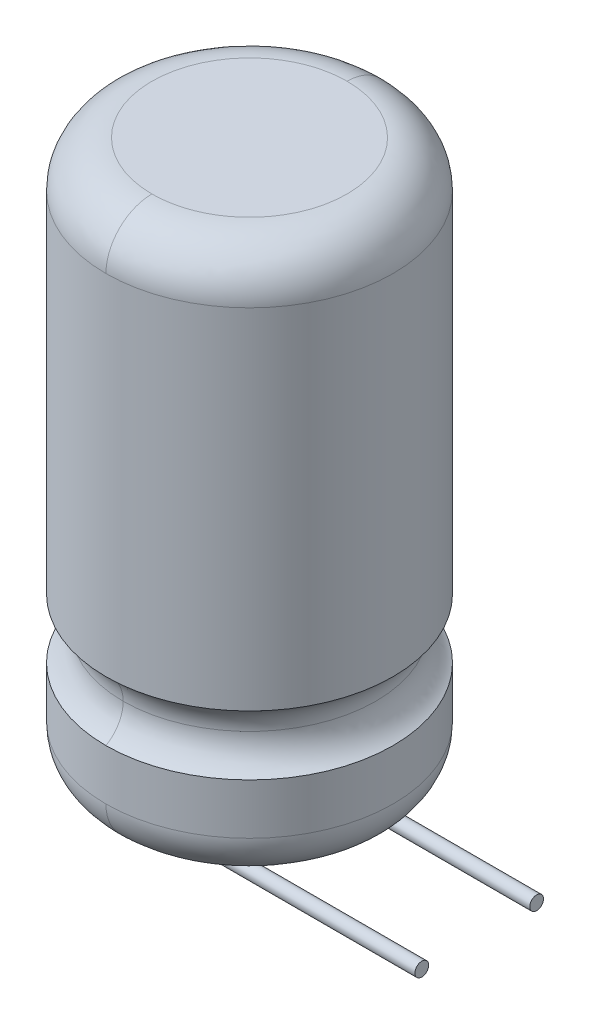
ISO-10303-21;
HEADER;
FILE_DESCRIPTION(('STEP AP214'),'2;1');
FILE_NAME('part.step','',(''),(''),'','','');
FILE_SCHEMA(('AUTOMOTIVE_DESIGN { 1 0 10303 214 1 1 1 1 }'));
ENDSEC;
DATA;
#1=APPLICATION_CONTEXT('core data for automotive mechanical design processes');
#2=APPLICATION_PROTOCOL_DEFINITION('international standard','automotive_design',2000,#1);
#3=PRODUCT_CONTEXT('',#1,'mechanical');
#4=PRODUCT('Part','Part','',(#3));
#5=PRODUCT_RELATED_PRODUCT_CATEGORY('part','',(#4));
#6=PRODUCT_DEFINITION_FORMATION('','',#4);
#7=PRODUCT_DEFINITION_CONTEXT('part definition',#1,'design');
#8=PRODUCT_DEFINITION('design','',#6,#7);
#9=PRODUCT_DEFINITION_SHAPE('','',#8);
#10=(LENGTH_UNIT() NAMED_UNIT(*) SI_UNIT(.MILLI.,.METRE.));
#11=(NAMED_UNIT(*) PLANE_ANGLE_UNIT() SI_UNIT($,.RADIAN.));
#12=(NAMED_UNIT(*) SI_UNIT($,.STERADIAN.) SOLID_ANGLE_UNIT());
#13=UNCERTAINTY_MEASURE_WITH_UNIT(LENGTH_MEASURE(1.E-05),#10,'distance_accuracy_value','');
#14=(GEOMETRIC_REPRESENTATION_CONTEXT(3) GLOBAL_UNCERTAINTY_ASSIGNED_CONTEXT((#13)) GLOBAL_UNIT_ASSIGNED_CONTEXT((#10,
#11,#12)) REPRESENTATION_CONTEXT('',''));
#15=CARTESIAN_POINT('',(0.,0.,0.));
#16=DIRECTION('',(0.,0.,1.));
#17=DIRECTION('',(1.,0.,0.));
#18=AXIS2_PLACEMENT_3D('',#15,#16,#17);
#19=CARTESIAN_POINT('',(10.,-1.4036,2.8036));
#20=DIRECTION('',(1.,0.,0.));
#21=DIRECTION('',(0.,0.,-1.));
#22=AXIS2_PLACEMENT_3D('',#19,#20,#21);
#23=PLANE('',#22);
#24=CARTESIAN_POINT('',(10.,-1.1,2.5));
#25=DIRECTION('',(1.,0.,0.));
#26=DIRECTION('',(0.,0.,-1.));
#27=AXIS2_PLACEMENT_3D('',#24,#25,#26);
#28=CIRCLE('',#27,0.3);
#29=CARTESIAN_POINT('',(10.,-1.1,2.2));
#30=VERTEX_POINT('',#29);
#31=EDGE_CURVE('E107',#30,#30,#28,.T.);
#32=ORIENTED_EDGE('',*,*,#31,.T.);
#33=EDGE_LOOP('',(#32));
#34=FACE_BOUND('',#33,.T.);
#35=ADVANCED_FACE('F16',(#34),#23,.T.);
#36=CARTESIAN_POINT('',(10.,-1.4036,-2.1964));
#37=DIRECTION('',(1.,0.,0.));
#38=DIRECTION('',(0.,0.,-1.));
#39=AXIS2_PLACEMENT_3D('',#36,#37,#38);
#40=PLANE('',#39);
#41=CARTESIAN_POINT('',(10.,-1.1,-2.5));
#42=DIRECTION('',(1.,0.,0.));
#43=DIRECTION('',(0.,0.,-1.));
#44=AXIS2_PLACEMENT_3D('',#41,#42,#43);
#45=CIRCLE('',#44,0.3);
#46=CARTESIAN_POINT('',(10.,-1.1,-2.8));
#47=VERTEX_POINT('',#46);
#48=EDGE_CURVE('E106',#47,#47,#45,.T.);
#49=ORIENTED_EDGE('',*,*,#48,.T.);
#50=EDGE_LOOP('',(#49));
#51=FACE_BOUND('',#50,.T.);
#52=ADVANCED_FACE('F150',(#51),#40,.T.);
#53=CARTESIAN_POINT('',(1.,-1.1,2.5));
#54=DIRECTION('',(1.,0.,0.));
#55=DIRECTION('',(0.,0.,-1.));
#56=AXIS2_PLACEMENT_3D('',#53,#54,#55);
#57=CYLINDRICAL_SURFACE('',#56,0.3);
#58=ORIENTED_EDGE('',*,*,#31,.F.);
#59=EDGE_LOOP('',(#58));
#60=FACE_BOUND('',#59,.T.);
#61=CARTESIAN_POINT('',(1.,-1.1,2.5));
#62=DIRECTION('',(1.,0.,0.));
#63=DIRECTION('',(0.,0.,-1.));
#64=AXIS2_PLACEMENT_3D('',#61,#62,#63);
#65=CIRCLE('',#64,0.3);
#66=CARTESIAN_POINT('',(1.,-1.40000000010315,2.49999999996849));
#67=VERTEX_POINT('',#66);
#68=CARTESIAN_POINT('',(1.,-0.8,2.50000000006153));
#69=VERTEX_POINT('',#68);
#70=EDGE_CURVE('E101',#67,#69,#65,.F.);
#71=ORIENTED_EDGE('',*,*,#70,.F.);
#72=CARTESIAN_POINT('',(1.,-1.1,2.5));
#73=DIRECTION('',(1.,0.,0.));
#74=DIRECTION('',(0.,0.,-1.));
#75=AXIS2_PLACEMENT_3D('',#72,#73,#74);
#76=CIRCLE('',#75,0.3);
#77=EDGE_CURVE('E98',#69,#67,#76,.F.);
#78=ORIENTED_EDGE('',*,*,#77,.F.);
#79=EDGE_LOOP('',(#71,#78));
#80=FACE_BOUND('',#79,.T.);
#81=ADVANCED_FACE('F100',(#60,#80),#57,.T.);
#82=CARTESIAN_POINT('',(1.,-1.1,-2.5));
#83=DIRECTION('',(1.,0.,0.));
#84=DIRECTION('',(0.,0.,-1.));
#85=AXIS2_PLACEMENT_3D('',#82,#83,#84);
#86=CYLINDRICAL_SURFACE('',#85,0.3);
#87=ORIENTED_EDGE('',*,*,#48,.F.);
#88=EDGE_LOOP('',(#87));
#89=FACE_BOUND('',#88,.T.);
#90=CARTESIAN_POINT('',(1.,-1.1,-2.5));
#91=DIRECTION('',(1.,0.,0.));
#92=DIRECTION('',(0.,0.,-1.));
#93=AXIS2_PLACEMENT_3D('',#90,#91,#92);
#94=CIRCLE('',#93,0.3);
#95=CARTESIAN_POINT('',(1.,-1.40000000010315,-2.50000000003151));
#96=VERTEX_POINT('',#95);
#97=CARTESIAN_POINT('',(1.,-0.8,-2.49999999993847));
#98=VERTEX_POINT('',#97);
#99=EDGE_CURVE('E122',#96,#98,#94,.F.);
#100=ORIENTED_EDGE('',*,*,#99,.F.);
#101=CARTESIAN_POINT('',(1.,-1.1,-2.5));
#102=DIRECTION('',(1.,0.,0.));
#103=DIRECTION('',(0.,0.,-1.));
#104=AXIS2_PLACEMENT_3D('',#101,#102,#103);
#105=CIRCLE('',#104,0.3);
#106=EDGE_CURVE('E116',#98,#96,#105,.F.);
#107=ORIENTED_EDGE('',*,*,#106,.F.);
#108=EDGE_LOOP('',(#100,#107));
#109=FACE_BOUND('',#108,.T.);
#110=ADVANCED_FACE('F218',(#89,#109),#86,.T.);
#111=CARTESIAN_POINT('',(0.29850125,-0.1,2.470049975));
#112=CARTESIAN_POINT('',(0.29850125,-0.510928454,2.470049975));
#113=CARTESIAN_POINT('',(0.589071546,-0.80149875,2.470049975));
#114=CARTESIAN_POINT('',(1.,-0.80149875,2.470049975));
#115=CARTESIAN_POINT('',(0.317469721,-0.1,2.659101988));
#116=CARTESIAN_POINT('',(0.317469721,-0.499816981,2.659101988));
#117=CARTESIAN_POINT('',(0.600183019,-0.782530279,2.659101988));
#118=CARTESIAN_POINT('',(1.,-0.782530279,2.659101988));
#119=CARTESIAN_POINT('',(0.190001228,-0.1,2.8));
#120=CARTESIAN_POINT('',(0.190001228,-0.574486295,2.8));
#121=CARTESIAN_POINT('',(0.525513705,-0.909998772,2.8));
#122=CARTESIAN_POINT('',(1.,-0.909998772,2.8));
#123=CARTESIAN_POINT('',(0.,-0.1,2.8));
#124=CARTESIAN_POINT('',(0.,-0.685786438,2.8));
#125=CARTESIAN_POINT('',(0.414213562,-1.1,2.8));
#126=CARTESIAN_POINT('',(1.,-1.1,2.8));
#127=CARTESIAN_POINT('',(-0.190001228,-0.1,2.8));
#128=CARTESIAN_POINT('',(-0.190001228,-0.79708658,2.8));
#129=CARTESIAN_POINT('',(0.30291342,-1.290001228,2.8));
#130=CARTESIAN_POINT('',(1.,-1.290001228,2.8));
#131=CARTESIAN_POINT('',(-0.317469721,-0.1,2.659101988));
#132=CARTESIAN_POINT('',(-0.317469721,-0.871755895,2.659101988));
#133=CARTESIAN_POINT('',(0.228244105,-1.417469721,2.659101988));
#134=CARTESIAN_POINT('',(1.,-1.417469721,2.659101988));
#135=CARTESIAN_POINT('',(-0.29850125,-0.1,2.470049975));
#136=CARTESIAN_POINT('',(-0.29850125,-0.860644421,2.470049975));
#137=CARTESIAN_POINT('',(0.239355579,-1.39850125,2.470049975));
#138=CARTESIAN_POINT('',(1.,-1.39850125,2.470049975));
#139=(BOUNDED_SURFACE() B_SPLINE_SURFACE(3,3,((#111,#112,#113,#114),(#115,#116,#117,#118),(#119,
#120,#121,#122),(#123,#124,#125,#126),(#127,#128,#129,#130),(#131,#132,#133,#134),(#135,#136,
#137,#138)),.UNSPECIFIED.,.F.,.F.,.F.) B_SPLINE_SURFACE_WITH_KNOTS((4,3,4),(4,4),(0.,0.5,1.),
(0.,1.),.UNSPECIFIED.) GEOMETRIC_REPRESENTATION_ITEM() RATIONAL_B_SPLINE_SURFACE(((1.,
0.804737854124365,0.804737854124365,1.),(0.780588314885162,0.62816896547524,0.62816896547524,
0.780588314885162),(0.780588314885162,0.62816896547524,0.62816896547524,0.780588314885162),(1.,
0.804737854124365,0.804737854124365,1.),(0.780588314885162,0.62816896547524,0.62816896547524,
0.780588314885162),(0.780588314885162,0.62816896547524,0.62816896547524,0.780588314885162),(1.,
0.804737854124365,0.804737854124365,1.))) REPRESENTATION_ITEM('') SURFACE());
#140=CARTESIAN_POINT('',(1.,-0.0999999999999998,2.50000000032535));
#141=DIRECTION('',(0.,0.,-1.));
#142=DIRECTION('',(-1.,0.,0.));
#143=AXIS2_PLACEMENT_3D('',#140,#141,#142);
#144=CIRCLE('',#143,0.699999999690537);
#145=CARTESIAN_POINT('',(0.300000000154731,-0.1,2.50000000013191));
#146=VERTEX_POINT('',#145);
#147=EDGE_CURVE('E113',#69,#146,#144,.T.);
#148=CARTESIAN_POINT('',(0.,-0.1,2.5));
#149=DIRECTION('',(0.,1.,0.));
#150=DIRECTION('',(0.,0.,1.));
#151=AXIS2_PLACEMENT_3D('',#148,#149,#150);
#152=CIRCLE('',#151,0.3);
#153=CARTESIAN_POINT('',(-0.300000000154732,-0.1,2.49999999977962));
#154=VERTEX_POINT('',#153);
#155=EDGE_CURVE('E120',#146,#154,#152,.F.);
#156=CARTESIAN_POINT('',(0.999999999999999,-0.1,2.49999999967465));
#157=DIRECTION('',(0.,0.,-1.));
#158=DIRECTION('',(-1.,0.,0.));
#159=AXIS2_PLACEMENT_3D('',#156,#157,#158);
#160=CIRCLE('',#159,1.30000000030946);
#161=EDGE_CURVE('E115',#67,#154,#160,.T.);
#162=ORIENTED_EDGE('',*,*,#147,.T.);
#163=ORIENTED_EDGE('',*,*,#155,.T.);
#164=ORIENTED_EDGE('',*,*,#161,.F.);
#165=ORIENTED_EDGE('',*,*,#70,.T.);
#166=EDGE_LOOP('',(#162,#163,#164,#165));
#167=FACE_BOUND('',#166,.T.);
#168=ADVANCED_FACE('F111',(#167),#139,.T.);
#169=CARTESIAN_POINT('',(0.29850125,-0.1,-2.529950025));
#170=CARTESIAN_POINT('',(0.29850125,-0.510928454,-2.529950025));
#171=CARTESIAN_POINT('',(0.589071546,-0.80149875,-2.529950025));
#172=CARTESIAN_POINT('',(1.,-0.80149875,-2.529950025));
#173=CARTESIAN_POINT('',(0.317469721,-0.1,-2.340898012));
#174=CARTESIAN_POINT('',(0.317469721,-0.499816981,-2.340898012));
#175=CARTESIAN_POINT('',(0.600183019,-0.782530279,-2.340898012));
#176=CARTESIAN_POINT('',(1.,-0.782530279,-2.340898012));
#177=CARTESIAN_POINT('',(0.190001228,-0.1,-2.2));
#178=CARTESIAN_POINT('',(0.190001228,-0.574486295,-2.2));
#179=CARTESIAN_POINT('',(0.525513705,-0.909998772,-2.2));
#180=CARTESIAN_POINT('',(1.,-0.909998772,-2.2));
#181=CARTESIAN_POINT('',(0.,-0.1,-2.2));
#182=CARTESIAN_POINT('',(0.,-0.685786438,-2.2));
#183=CARTESIAN_POINT('',(0.414213562,-1.1,-2.2));
#184=CARTESIAN_POINT('',(1.,-1.1,-2.2));
#185=CARTESIAN_POINT('',(-0.190001228,-0.1,-2.2));
#186=CARTESIAN_POINT('',(-0.190001228,-0.79708658,-2.2));
#187=CARTESIAN_POINT('',(0.30291342,-1.290001228,-2.2));
#188=CARTESIAN_POINT('',(1.,-1.290001228,-2.2));
#189=CARTESIAN_POINT('',(-0.317469721,-0.1,-2.340898012));
#190=CARTESIAN_POINT('',(-0.317469721,-0.871755895,-2.340898012));
#191=CARTESIAN_POINT('',(0.228244105,-1.417469721,-2.340898012));
#192=CARTESIAN_POINT('',(1.,-1.417469721,-2.340898012));
#193=CARTESIAN_POINT('',(-0.29850125,-0.1,-2.529950025));
#194=CARTESIAN_POINT('',(-0.29850125,-0.860644421,-2.529950025));
#195=CARTESIAN_POINT('',(0.239355579,-1.39850125,-2.529950025));
#196=CARTESIAN_POINT('',(1.,-1.39850125,-2.529950025));
#197=(BOUNDED_SURFACE() B_SPLINE_SURFACE(3,3,((#169,#170,#171,#172),(#173,#174,#175,#176),(#177,
#178,#179,#180),(#181,#182,#183,#184),(#185,#186,#187,#188),(#189,#190,#191,#192),(#193,#194,
#195,#196)),.UNSPECIFIED.,.F.,.F.,.F.) B_SPLINE_SURFACE_WITH_KNOTS((4,3,4),(4,4),(0.,0.5,1.),
(0.,1.),.UNSPECIFIED.) GEOMETRIC_REPRESENTATION_ITEM() RATIONAL_B_SPLINE_SURFACE(((1.,
0.804737854124365,0.804737854124365,1.),(0.780588314885162,0.62816896547524,0.62816896547524,
0.780588314885162),(0.780588314885162,0.62816896547524,0.62816896547524,0.780588314885162),(1.,
0.804737854124365,0.804737854124365,1.),(0.780588314885162,0.62816896547524,0.62816896547524,
0.780588314885162),(0.780588314885162,0.62816896547524,0.62816896547524,0.780588314885162),(1.,
0.804737854124365,0.804737854124365,1.))) REPRESENTATION_ITEM('') SURFACE());
#198=CARTESIAN_POINT('',(1.,-0.0999999999999998,-2.49999999967465));
#199=DIRECTION('',(0.,0.,-1.));
#200=DIRECTION('',(-1.,0.,0.));
#201=AXIS2_PLACEMENT_3D('',#198,#199,#200);
#202=CIRCLE('',#201,0.699999999690537);
#203=CARTESIAN_POINT('',(0.300000000154731,-0.1,-2.49999999986809));
#204=VERTEX_POINT('',#203);
#205=EDGE_CURVE('E193',#98,#204,#202,.T.);
#206=CARTESIAN_POINT('',(0.,-0.1,-2.5));
#207=DIRECTION('',(0.,1.,0.));
#208=DIRECTION('',(0.,0.,1.));
#209=AXIS2_PLACEMENT_3D('',#206,#207,#208);
#210=CIRCLE('',#209,0.3);
#211=CARTESIAN_POINT('',(-0.300000000154732,-0.1,-2.50000000022038));
#212=VERTEX_POINT('',#211);
#213=EDGE_CURVE('E192',#204,#212,#210,.F.);
#214=CARTESIAN_POINT('',(0.999999999999999,-0.1,-2.50000000032535));
#215=DIRECTION('',(0.,0.,-1.));
#216=DIRECTION('',(-1.,0.,0.));
#217=AXIS2_PLACEMENT_3D('',#214,#215,#216);
#218=CIRCLE('',#217,1.30000000030946);
#219=EDGE_CURVE('E215',#96,#212,#218,.T.);
#220=ORIENTED_EDGE('',*,*,#205,.T.);
#221=ORIENTED_EDGE('',*,*,#213,.T.);
#222=ORIENTED_EDGE('',*,*,#219,.F.);
#223=ORIENTED_EDGE('',*,*,#99,.T.);
#224=EDGE_LOOP('',(#220,#221,#222,#223));
#225=FACE_BOUND('',#224,.T.);
#226=ADVANCED_FACE('F219',(#225),#197,.T.);
#227=CARTESIAN_POINT('',(-0.29850125,-0.1,2.529950025));
#228=CARTESIAN_POINT('',(-0.29850125,-0.860644421,2.529950025));
#229=CARTESIAN_POINT('',(0.239355579,-1.39850125,2.529950025));
#230=CARTESIAN_POINT('',(1.,-1.39850125,2.529950025));
#231=CARTESIAN_POINT('',(-0.317469721,-0.1,2.340898012));
#232=CARTESIAN_POINT('',(-0.317469721,-0.871755895,2.340898012));
#233=CARTESIAN_POINT('',(0.228244105,-1.417469721,2.340898012));
#234=CARTESIAN_POINT('',(1.,-1.417469721,2.340898012));
#235=CARTESIAN_POINT('',(-0.190001228,-0.1,2.2));
#236=CARTESIAN_POINT('',(-0.190001228,-0.79708658,2.2));
#237=CARTESIAN_POINT('',(0.30291342,-1.290001228,2.2));
#238=CARTESIAN_POINT('',(1.,-1.290001228,2.2));
#239=CARTESIAN_POINT('',(0.,-0.1,2.2));
#240=CARTESIAN_POINT('',(0.,-0.685786438,2.2));
#241=CARTESIAN_POINT('',(0.414213562,-1.1,2.2));
#242=CARTESIAN_POINT('',(1.,-1.1,2.2));
#243=CARTESIAN_POINT('',(0.190001228,-0.1,2.2));
#244=CARTESIAN_POINT('',(0.190001228,-0.574486295,2.2));
#245=CARTESIAN_POINT('',(0.525513705,-0.909998772,2.2));
#246=CARTESIAN_POINT('',(1.,-0.909998772,2.2));
#247=CARTESIAN_POINT('',(0.317469721,-0.1,2.340898012));
#248=CARTESIAN_POINT('',(0.317469721,-0.499816981,2.340898012));
#249=CARTESIAN_POINT('',(0.600183019,-0.782530279,2.340898012));
#250=CARTESIAN_POINT('',(1.,-0.782530279,2.340898012));
#251=CARTESIAN_POINT('',(0.29850125,-0.1,2.529950025));
#252=CARTESIAN_POINT('',(0.29850125,-0.510928454,2.529950025));
#253=CARTESIAN_POINT('',(0.589071546,-0.80149875,2.529950025));
#254=CARTESIAN_POINT('',(1.,-0.80149875,2.529950025));
#255=(BOUNDED_SURFACE() B_SPLINE_SURFACE(3,3,((#227,#228,#229,#230),(#231,#232,#233,#234),(#235,
#236,#237,#238),(#239,#240,#241,#242),(#243,#244,#245,#246),(#247,#248,#249,#250),(#251,#252,
#253,#254)),.UNSPECIFIED.,.F.,.F.,.F.) B_SPLINE_SURFACE_WITH_KNOTS((4,3,4),(4,4),(0.,0.5,1.),
(0.,1.),.UNSPECIFIED.) GEOMETRIC_REPRESENTATION_ITEM() RATIONAL_B_SPLINE_SURFACE(((1.,
0.804737854124365,0.804737854124365,1.),(0.780588314885162,0.62816896547524,0.62816896547524,
0.780588314885162),(0.780588314885162,0.62816896547524,0.62816896547524,0.780588314885162),(1.,
0.804737854124365,0.804737854124365,1.),(0.780588314885162,0.62816896547524,0.62816896547524,
0.780588314885162),(0.780588314885162,0.62816896547524,0.62816896547524,0.780588314885162),(1.,
0.804737854124365,0.804737854124365,1.))) REPRESENTATION_ITEM('') SURFACE());
#256=CARTESIAN_POINT('',(0.,-0.1,2.5));
#257=DIRECTION('',(0.,1.,0.));
#258=DIRECTION('',(0.,0.,1.));
#259=AXIS2_PLACEMENT_3D('',#256,#257,#258);
#260=CIRCLE('',#259,0.3);
#261=EDGE_CURVE('E119',#154,#146,#260,.F.);
#262=ORIENTED_EDGE('',*,*,#77,.T.);
#263=ORIENTED_EDGE('',*,*,#161,.T.);
#264=ORIENTED_EDGE('',*,*,#261,.T.);
#265=ORIENTED_EDGE('',*,*,#147,.F.);
#266=EDGE_LOOP('',(#262,#263,#264,#265));
#267=FACE_BOUND('',#266,.T.);
#268=ADVANCED_FACE('F117',(#267),#255,.T.);
#269=CARTESIAN_POINT('',(-0.29850125,-0.1,-2.470049975));
#270=CARTESIAN_POINT('',(-0.29850125,-0.860644421,-2.470049975));
#271=CARTESIAN_POINT('',(0.239355579,-1.39850125,-2.470049975));
#272=CARTESIAN_POINT('',(1.,-1.39850125,-2.470049975));
#273=CARTESIAN_POINT('',(-0.317469721,-0.1,-2.659101988));
#274=CARTESIAN_POINT('',(-0.317469721,-0.871755895,-2.659101988));
#275=CARTESIAN_POINT('',(0.228244105,-1.417469721,-2.659101988));
#276=CARTESIAN_POINT('',(1.,-1.417469721,-2.659101988));
#277=CARTESIAN_POINT('',(-0.190001228,-0.1,-2.8));
#278=CARTESIAN_POINT('',(-0.190001228,-0.79708658,-2.8));
#279=CARTESIAN_POINT('',(0.30291342,-1.290001228,-2.8));
#280=CARTESIAN_POINT('',(1.,-1.290001228,-2.8));
#281=CARTESIAN_POINT('',(0.,-0.1,-2.8));
#282=CARTESIAN_POINT('',(0.,-0.685786438,-2.8));
#283=CARTESIAN_POINT('',(0.414213562,-1.1,-2.8));
#284=CARTESIAN_POINT('',(1.,-1.1,-2.8));
#285=CARTESIAN_POINT('',(0.190001228,-0.1,-2.8));
#286=CARTESIAN_POINT('',(0.190001228,-0.574486295,-2.8));
#287=CARTESIAN_POINT('',(0.525513705,-0.909998772,-2.8));
#288=CARTESIAN_POINT('',(1.,-0.909998772,-2.8));
#289=CARTESIAN_POINT('',(0.317469721,-0.1,-2.659101988));
#290=CARTESIAN_POINT('',(0.317469721,-0.499816981,-2.659101988));
#291=CARTESIAN_POINT('',(0.600183019,-0.782530279,-2.659101988));
#292=CARTESIAN_POINT('',(1.,-0.782530279,-2.659101988));
#293=CARTESIAN_POINT('',(0.29850125,-0.1,-2.470049975));
#294=CARTESIAN_POINT('',(0.29850125,-0.510928454,-2.470049975));
#295=CARTESIAN_POINT('',(0.589071546,-0.80149875,-2.470049975));
#296=CARTESIAN_POINT('',(1.,-0.80149875,-2.470049975));
#297=(BOUNDED_SURFACE() B_SPLINE_SURFACE(3,3,((#269,#270,#271,#272),(#273,#274,#275,#276),(#277,
#278,#279,#280),(#281,#282,#283,#284),(#285,#286,#287,#288),(#289,#290,#291,#292),(#293,#294,
#295,#296)),.UNSPECIFIED.,.F.,.F.,.F.) B_SPLINE_SURFACE_WITH_KNOTS((4,3,4),(4,4),(0.,0.5,1.),
(0.,1.),.UNSPECIFIED.) GEOMETRIC_REPRESENTATION_ITEM() RATIONAL_B_SPLINE_SURFACE(((1.,
0.804737854124365,0.804737854124365,1.),(0.780588314885162,0.62816896547524,0.62816896547524,
0.780588314885162),(0.780588314885162,0.62816896547524,0.62816896547524,0.780588314885162),(1.,
0.804737854124365,0.804737854124365,1.),(0.780588314885162,0.62816896547524,0.62816896547524,
0.780588314885162),(0.780588314885162,0.62816896547524,0.62816896547524,0.780588314885162),(1.,
0.804737854124365,0.804737854124365,1.))) REPRESENTATION_ITEM('') SURFACE());
#298=CARTESIAN_POINT('',(0.,-0.1,-2.5));
#299=DIRECTION('',(0.,1.,0.));
#300=DIRECTION('',(0.,0.,1.));
#301=AXIS2_PLACEMENT_3D('',#298,#299,#300);
#302=CIRCLE('',#301,0.3);
#303=EDGE_CURVE('E221',#212,#204,#302,.F.);
#304=ORIENTED_EDGE('',*,*,#106,.T.);
#305=ORIENTED_EDGE('',*,*,#219,.T.);
#306=ORIENTED_EDGE('',*,*,#303,.T.);
#307=ORIENTED_EDGE('',*,*,#205,.F.);
#308=EDGE_LOOP('',(#304,#305,#306,#307));
#309=FACE_BOUND('',#308,.T.);
#310=ADVANCED_FACE('F214',(#309),#297,.T.);
#311=CARTESIAN_POINT('',(0.,-0.1,2.5));
#312=DIRECTION('',(0.,1.,0.));
#313=DIRECTION('',(0.,0.,1.));
#314=AXIS2_PLACEMENT_3D('',#311,#312,#313);
#315=CYLINDRICAL_SURFACE('',#314,0.3);
#316=ORIENTED_EDGE('',*,*,#261,.F.);
#317=ORIENTED_EDGE('',*,*,#155,.F.);
#318=EDGE_LOOP('',(#316,#317));
#319=FACE_BOUND('',#318,.T.);
#320=CARTESIAN_POINT('',(0.,0.,2.5));
#321=DIRECTION('',(0.,1.,0.));
#322=DIRECTION('',(0.,0.,1.));
#323=AXIS2_PLACEMENT_3D('',#320,#321,#322);
#324=CIRCLE('',#323,0.3);
#325=CARTESIAN_POINT('',(0.,0.,2.8));
#326=VERTEX_POINT('',#325);
#327=EDGE_CURVE('E188',#326,#326,#324,.F.);
#328=ORIENTED_EDGE('',*,*,#327,.T.);
#329=EDGE_LOOP('',(#328));
#330=FACE_BOUND('',#329,.T.);
#331=ADVANCED_FACE('F272',(#319,#330),#315,.T.);
#332=CARTESIAN_POINT('',(0.,-0.1,-2.5));
#333=DIRECTION('',(0.,1.,0.));
#334=DIRECTION('',(0.,0.,1.));
#335=AXIS2_PLACEMENT_3D('',#332,#333,#334);
#336=CYLINDRICAL_SURFACE('',#335,0.3);
#337=ORIENTED_EDGE('',*,*,#303,.F.);
#338=ORIENTED_EDGE('',*,*,#213,.F.);
#339=EDGE_LOOP('',(#337,#338));
#340=FACE_BOUND('',#339,.T.);
#341=CARTESIAN_POINT('',(0.,0.,-2.5));
#342=DIRECTION('',(0.,1.,0.));
#343=DIRECTION('',(0.,0.,1.));
#344=AXIS2_PLACEMENT_3D('',#341,#342,#343);
#345=CIRCLE('',#344,0.3);
#346=CARTESIAN_POINT('',(0.,0.,-2.2));
#347=VERTEX_POINT('',#346);
#348=EDGE_CURVE('E180',#347,#347,#345,.F.);
#349=ORIENTED_EDGE('',*,*,#348,.T.);
#350=EDGE_LOOP('',(#349));
#351=FACE_BOUND('',#350,.T.);
#352=ADVANCED_FACE('F263',(#340,#351),#336,.T.);
#353=CARTESIAN_POINT('',(0.,6.867423388,6.383434288));
#354=CARTESIAN_POINT('',(-12.766868577,6.867423388,6.383434288));
#355=CARTESIAN_POINT('',(-12.766868577,6.867423388,-6.383434288));
#356=CARTESIAN_POINT('',(0.,6.867423388,-6.383434288));
#357=CARTESIAN_POINT('',(0.,6.592949516,5.774704375));
#358=CARTESIAN_POINT('',(-11.549408749,6.592949516,5.774704375));
#359=CARTESIAN_POINT('',(-11.549408749,6.592949516,-5.774704375));
#360=CARTESIAN_POINT('',(0.,6.592949516,-5.774704375));
#361=CARTESIAN_POINT('',(0.,6.014662381,5.440830141));
#362=CARTESIAN_POINT('',(-10.881660282,6.014662381,5.440830141));
#363=CARTESIAN_POINT('',(-10.881660282,6.014662381,-5.440830141));
#364=CARTESIAN_POINT('',(0.,6.014662381,-5.440830141));
#365=CARTESIAN_POINT('',(0.,5.350249875,5.507493752));
#366=CARTESIAN_POINT('',(-11.014987504,5.350249875,5.507493752));
#367=CARTESIAN_POINT('',(-11.014987504,5.350249875,-5.507493752));
#368=CARTESIAN_POINT('',(0.,5.350249875,-5.507493752));
#369=(BOUNDED_SURFACE() B_SPLINE_SURFACE(3,3,((#353,#354,#355,#356),(#357,#358,#359,#360),(#361,
#362,#363,#364),(#365,#366,#367,#368)),.UNSPECIFIED.,.F.,.F.,
.F.) B_SPLINE_SURFACE_WITH_KNOTS((4,4),(4,4),(0.,1.),(0.,1.),
.UNSPECIFIED.) GEOMETRIC_REPRESENTATION_ITEM() RATIONAL_B_SPLINE_SURFACE(((1.,0.333333333333333,
0.333333333333333,1.),(0.874521450452458,0.291507150150819,0.291507150150819,0.874521450452458),
(0.874521450452458,0.291507150150819,0.291507150150819,0.874521450452458),(1.,0.333333333333333,
0.333333333333333,1.))) REPRESENTATION_ITEM('') SURFACE());
#370=CARTESIAN_POINT('',(0.,6.867423388,6.383434288));
#371=CARTESIAN_POINT('',(0.,6.592949516,5.774704375));
#372=CARTESIAN_POINT('',(0.,6.014662381,5.440830141));
#373=CARTESIAN_POINT('',(0.,5.350249875,5.507493752));
#374=(BOUNDED_CURVE() B_SPLINE_CURVE(3,(#370,#371,#372,#373),.UNSPECIFIED.,.F.,
.F.) B_SPLINE_CURVE_WITH_KNOTS((4,4),(0.,1.),
.UNSPECIFIED.) CURVE() GEOMETRIC_REPRESENTATION_ITEM() RATIONAL_B_SPLINE_CURVE((1.,
0.874521450452458,0.874521450452458,1.)) REPRESENTATION_ITEM(''));
#375=CARTESIAN_POINT('',(-9.61422321165615E-10,6.79903810554969,6.24999999983468));
#376=VERTEX_POINT('',#375);
#377=CARTESIAN_POINT('',(0.,5.49999999999748,5.49999999990509));
#378=VERTEX_POINT('',#377);
#379=EDGE_CURVE('E446',#376,#378,#374,.T.);
#380=CARTESIAN_POINT('',(0.,6.799038106,0.));
#381=DIRECTION('',(0.,-1.,0.));
#382=DIRECTION('',(0.,0.,-1.));
#383=AXIS2_PLACEMENT_3D('',#380,#381,#382);
#384=CIRCLE('',#383,6.25);
#385=CARTESIAN_POINT('',(-2.80605088839791E-10,6.79903810554969,-6.24999999983468));
#386=VERTEX_POINT('',#385);
#387=EDGE_CURVE('E436',#376,#386,#384,.T.);
#388=CARTESIAN_POINT('',(0.,6.867423388,-6.383434288));
#389=CARTESIAN_POINT('',(0.,6.592949516,-5.774704375));
#390=CARTESIAN_POINT('',(0.,6.014662381,-5.440830141));
#391=CARTESIAN_POINT('',(0.,5.350249875,-5.507493752));
#392=(BOUNDED_CURVE() B_SPLINE_CURVE(3,(#388,#389,#390,#391),.UNSPECIFIED.,.F.,
.F.) B_SPLINE_CURVE_WITH_KNOTS((4,4),(0.,1.),
.UNSPECIFIED.) CURVE() GEOMETRIC_REPRESENTATION_ITEM() RATIONAL_B_SPLINE_CURVE((1.,
0.874521450452458,0.874521450452458,1.)) REPRESENTATION_ITEM(''));
#393=CARTESIAN_POINT('',(0.,5.5,-5.49999999990509));
#394=VERTEX_POINT('',#393);
#395=EDGE_CURVE('E231',#394,#386,#392,.F.);
#396=CARTESIAN_POINT('',(0.,5.50000000001007,0.));
#397=DIRECTION('',(0.,1.,0.));
#398=DIRECTION('',(-1.,0.,0.));
#399=AXIS2_PLACEMENT_3D('',#396,#397,#398);
#400=CIRCLE('',#399,5.49999999990508);
#401=EDGE_CURVE('E485',#394,#378,#400,.T.);
#402=ORIENTED_EDGE('',*,*,#379,.F.);
#403=ORIENTED_EDGE('',*,*,#387,.T.);
#404=ORIENTED_EDGE('',*,*,#395,.F.);
#405=ORIENTED_EDGE('',*,*,#401,.T.);
#406=EDGE_LOOP('',(#402,#403,#404,#405));
#407=FACE_BOUND('',#406,.T.);
#408=ADVANCED_FACE('F149',(#407),#369,.F.);
#409=CARTESIAN_POINT('',(-4.301,24.,-4.301));
#410=DIRECTION('',(0.,1.,0.));
#411=DIRECTION('',(0.,0.,1.));
#412=AXIS2_PLACEMENT_3D('',#409,#410,#411);
#413=PLANE('',#412);
#414=CARTESIAN_POINT('',(0.,24.0000000003185,-4.25000000129863));
#415=CARTESIAN_POINT('',(8.50000000187751,24.0000000003185,-4.25000000129863));
#416=CARTESIAN_POINT('',(8.50000000187751,24.0000000003185,4.25000000129863));
#417=CARTESIAN_POINT('',(0.,24.0000000003185,4.25000000129863));
#418=(BOUNDED_CURVE() B_SPLINE_CURVE(3,(#414,#415,#416,#417),.UNSPECIFIED.,.F.,
.F.) B_SPLINE_CURVE_WITH_KNOTS((4,4),(0.,1.),
.UNSPECIFIED.) CURVE() GEOMETRIC_REPRESENTATION_ITEM() RATIONAL_B_SPLINE_CURVE((0.956578302130086,
0.318859434043362,0.318859434043362,0.956578302130086)) REPRESENTATION_ITEM(''));
#419=CARTESIAN_POINT('',(0.,24.0000000001911,-4.24999999989973));
#420=VERTEX_POINT('',#419);
#421=CARTESIAN_POINT('',(0.,24.0000000001911,4.24999999989973));
#422=VERTEX_POINT('',#421);
#423=EDGE_CURVE('E134',#420,#422,#418,.T.);
#424=ORIENTED_EDGE('',*,*,#423,.F.);
#425=CARTESIAN_POINT('',(0.,24.0000000003185,4.25000000129863));
#426=CARTESIAN_POINT('',(-8.50000000187752,24.0000000003185,4.25000000129863));
#427=CARTESIAN_POINT('',(-8.50000000187752,24.0000000003185,-4.25000000129863));
#428=CARTESIAN_POINT('',(0.,24.0000000003185,-4.25000000129863));
#429=(BOUNDED_CURVE() B_SPLINE_CURVE(3,(#425,#426,#427,#428),.UNSPECIFIED.,.F.,
.F.) B_SPLINE_CURVE_WITH_KNOTS((4,4),(0.,1.),
.UNSPECIFIED.) CURVE() GEOMETRIC_REPRESENTATION_ITEM() RATIONAL_B_SPLINE_CURVE((0.956578302130086,
0.318859434043362,0.318859434043362,0.956578302130086)) REPRESENTATION_ITEM(''));
#430=EDGE_CURVE('E191',#422,#420,#429,.T.);
#431=ORIENTED_EDGE('',*,*,#430,.F.);
#432=EDGE_LOOP('',(#424,#431));
#433=FACE_BOUND('',#432,.T.);
#434=ADVANCED_FACE('F139',(#433),#413,.T.);
#435=CARTESIAN_POINT('',(0.,23.990008331,-4.050333167));
#436=CARTESIAN_POINT('',(-8.100666333,23.990008331,-4.050333167));
#437=CARTESIAN_POINT('',(-8.100666333,23.990008331,4.050333167));
#438=CARTESIAN_POINT('',(0.,23.990008331,4.050333167));
#439=CARTESIAN_POINT('',(0.,24.126440845,-5.41010753));
#440=CARTESIAN_POINT('',(-10.820215061,24.126440845,-5.41010753));
#441=CARTESIAN_POINT('',(-10.820215061,24.126440845,5.41010753));
#442=CARTESIAN_POINT('',(0.,24.126440845,5.41010753));
#443=CARTESIAN_POINT('',(0.,23.16010753,-6.376440845));
#444=CARTESIAN_POINT('',(-12.752881691,23.16010753,-6.376440845));
#445=CARTESIAN_POINT('',(-12.752881691,23.16010753,6.376440845));
#446=CARTESIAN_POINT('',(0.,23.16010753,6.376440845));
#447=CARTESIAN_POINT('',(0.,21.800333167,-6.240008331));
#448=CARTESIAN_POINT('',(-12.480016661,21.800333167,-6.240008331));
#449=CARTESIAN_POINT('',(-12.480016661,21.800333167,6.240008331));
#450=CARTESIAN_POINT('',(0.,21.800333167,6.240008331));
#451=(BOUNDED_SURFACE() B_SPLINE_SURFACE(3,3,((#435,#436,#437,#438),(#439,#440,#441,#442),(#443,
#444,#445,#446),(#447,#448,#449,#450)),.UNSPECIFIED.,.F.,.F.,
.F.) B_SPLINE_SURFACE_WITH_KNOTS((4,4),(4,4),(0.,1.),(0.,1.),
.UNSPECIFIED.) GEOMETRIC_REPRESENTATION_ITEM() RATIONAL_B_SPLINE_SURFACE(((1.,0.333333333333333,
0.333333333333333,1.),(0.755320871117972,0.251773623705991,0.251773623705991,0.755320871117972),
(0.755320871117972,0.251773623705991,0.251773623705991,0.755320871117972),(1.,0.333333333333333,
0.333333333333333,1.))) REPRESENTATION_ITEM('') SURFACE());
#452=CARTESIAN_POINT('',(0.,23.990008331,4.050333167));
#453=CARTESIAN_POINT('',(0.,24.126440845,5.41010753));
#454=CARTESIAN_POINT('',(0.,23.16010753,6.376440845));
#455=CARTESIAN_POINT('',(0.,21.800333167,6.240008331));
#456=(BOUNDED_CURVE() B_SPLINE_CURVE(3,(#452,#453,#454,#455),.UNSPECIFIED.,.F.,
.F.) B_SPLINE_CURVE_WITH_KNOTS((4,4),(0.,1.),
.UNSPECIFIED.) CURVE() GEOMETRIC_REPRESENTATION_ITEM() RATIONAL_B_SPLINE_CURVE((1.,
0.755320871117972,0.755320871117972,1.)) REPRESENTATION_ITEM(''));
#457=CARTESIAN_POINT('',(-6.40948214089996E-10,22.0000000002328,6.25000000010616));
#458=VERTEX_POINT('',#457);
#459=EDGE_CURVE('E422',#422,#458,#456,.T.);
#460=CARTESIAN_POINT('',(0.,23.990008331,-4.050333167));
#461=CARTESIAN_POINT('',(0.,24.126440845,-5.41010753));
#462=CARTESIAN_POINT('',(0.,23.16010753,-6.376440845));
#463=CARTESIAN_POINT('',(0.,21.800333167,-6.240008331));
#464=(BOUNDED_CURVE() B_SPLINE_CURVE(3,(#460,#461,#462,#463),.UNSPECIFIED.,.F.,
.F.) B_SPLINE_CURVE_WITH_KNOTS((4,4),(0.,1.),
.UNSPECIFIED.) CURVE() GEOMETRIC_REPRESENTATION_ITEM() RATIONAL_B_SPLINE_CURVE((1.,
0.755320871117972,0.755320871117972,1.)) REPRESENTATION_ITEM(''));
#465=CARTESIAN_POINT('',(0.,22.0000000001397,-6.25000000007962));
#466=VERTEX_POINT('',#465);
#467=EDGE_CURVE('E410',#466,#420,#464,.F.);
#468=CARTESIAN_POINT('',(0.,22.,0.));
#469=DIRECTION('',(0.,-1.,0.));
#470=DIRECTION('',(0.,0.,-1.));
#471=AXIS2_PLACEMENT_3D('',#468,#469,#470);
#472=CIRCLE('',#471,6.25);
#473=EDGE_CURVE('E417',#466,#458,#472,.F.);
#474=ORIENTED_EDGE('',*,*,#459,.F.);
#475=ORIENTED_EDGE('',*,*,#430,.T.);
#476=ORIENTED_EDGE('',*,*,#467,.F.);
#477=ORIENTED_EDGE('',*,*,#473,.T.);
#478=EDGE_LOOP('',(#474,#475,#476,#477));
#479=FACE_BOUND('',#478,.T.);
#480=ADVANCED_FACE('F148',(#479),#451,.T.);
#481=CARTESIAN_POINT('',(-4.301,0.,-4.301));
#482=DIRECTION('',(0.,1.,0.));
#483=DIRECTION('',(0.,0.,1.));
#484=AXIS2_PLACEMENT_3D('',#481,#482,#483);
#485=PLANE('',#484);
#486=ORIENTED_EDGE('',*,*,#348,.F.);
#487=EDGE_LOOP('',(#486));
#488=FACE_BOUND('',#487,.T.);
#489=ORIENTED_EDGE('',*,*,#327,.F.);
#490=EDGE_LOOP('',(#489));
#491=FACE_BOUND('',#490,.T.);
#492=CARTESIAN_POINT('',(0.,-3.18488292003682E-10,4.25000000129863));
#493=CARTESIAN_POINT('',(8.50000000187752,-3.18488311852251E-10,4.25000000129863));
#494=CARTESIAN_POINT('',(8.50000000187752,-3.18488311852251E-10,-4.25000000129863));
#495=CARTESIAN_POINT('',(0.,-3.18488292003682E-10,-4.25000000129863));
#496=(BOUNDED_CURVE() B_SPLINE_CURVE(3,(#492,#493,#494,#495),.UNSPECIFIED.,.F.,
.F.) B_SPLINE_CURVE_WITH_KNOTS((4,4),(0.,1.),
.UNSPECIFIED.) CURVE() GEOMETRIC_REPRESENTATION_ITEM() RATIONAL_B_SPLINE_CURVE((0.956578302130086,
0.318859434043362,0.318859434043362,0.956578302130086)) REPRESENTATION_ITEM(''));
#497=CARTESIAN_POINT('',(0.,-1.91092977377799E-10,4.24999999989973));
#498=VERTEX_POINT('',#497);
#499=CARTESIAN_POINT('',(0.,-1.91092977377799E-10,-4.24999999989973));
#500=VERTEX_POINT('',#499);
#501=EDGE_CURVE('E165',#498,#500,#496,.T.);
#502=ORIENTED_EDGE('',*,*,#501,.F.);
#503=CARTESIAN_POINT('',(0.,-3.18488292003682E-10,-4.25000000129863));
#504=CARTESIAN_POINT('',(-8.50000000187752,-3.18488311852251E-10,-4.25000000129863));
#505=CARTESIAN_POINT('',(-8.50000000187752,-3.18488311852251E-10,4.25000000129863));
#506=CARTESIAN_POINT('',(0.,-3.18488292003682E-10,4.25000000129863));
#507=(BOUNDED_CURVE() B_SPLINE_CURVE(3,(#503,#504,#505,#506),.UNSPECIFIED.,.F.,
.F.) B_SPLINE_CURVE_WITH_KNOTS((4,4),(0.,1.),
.UNSPECIFIED.) CURVE() GEOMETRIC_REPRESENTATION_ITEM() RATIONAL_B_SPLINE_CURVE((0.956578302130086,
0.318859434043362,0.318859434043362,0.956578302130086)) REPRESENTATION_ITEM(''));
#508=EDGE_CURVE('E175',#500,#498,#507,.T.);
#509=ORIENTED_EDGE('',*,*,#508,.F.);
#510=EDGE_LOOP('',(#502,#509));
#511=FACE_BOUND('',#510,.T.);
#512=ADVANCED_FACE('F18',(#488,#491,#511),#485,.F.);
#513=CARTESIAN_POINT('',(0.,2.199666833,-6.240008331));
#514=CARTESIAN_POINT('',(-12.480016661,2.199666833,-6.240008331));
#515=CARTESIAN_POINT('',(-12.480016661,2.199666833,6.240008331));
#516=CARTESIAN_POINT('',(0.,2.199666833,6.240008331));
#517=CARTESIAN_POINT('',(0.,0.83989247,-6.376440845));
#518=CARTESIAN_POINT('',(-12.752881691,0.83989247,-6.376440845));
#519=CARTESIAN_POINT('',(-12.752881691,0.83989247,6.376440845));
#520=CARTESIAN_POINT('',(0.,0.83989247,6.376440845));
#521=CARTESIAN_POINT('',(0.,-0.126440845,-5.41010753));
#522=CARTESIAN_POINT('',(-10.820215061,-0.126440845,-5.41010753));
#523=CARTESIAN_POINT('',(-10.820215061,-0.126440845,5.41010753));
#524=CARTESIAN_POINT('',(0.,-0.126440845,5.41010753));
#525=CARTESIAN_POINT('',(0.,0.009991669,-4.050333167));
#526=CARTESIAN_POINT('',(-8.100666333,0.009991669,-4.050333167));
#527=CARTESIAN_POINT('',(-8.100666333,0.009991669,4.050333167));
#528=CARTESIAN_POINT('',(0.,0.009991669,4.050333167));
#529=(BOUNDED_SURFACE() B_SPLINE_SURFACE(3,3,((#513,#514,#515,#516),(#517,#518,#519,#520),(#521,
#522,#523,#524),(#525,#526,#527,#528)),.UNSPECIFIED.,.F.,.F.,
.F.) B_SPLINE_SURFACE_WITH_KNOTS((4,4),(4,4),(0.,1.),(0.,1.),
.UNSPECIFIED.) GEOMETRIC_REPRESENTATION_ITEM() RATIONAL_B_SPLINE_SURFACE(((1.,0.333333333333333,
0.333333333333333,1.),(0.755320871117972,0.251773623705991,0.251773623705991,0.755320871117972),
(0.755320871117972,0.251773623705991,0.251773623705991,0.755320871117972),(1.,0.333333333333333,
0.333333333333333,1.))) REPRESENTATION_ITEM('') SURFACE());
#530=CARTESIAN_POINT('',(0.,2.199666833,6.240008331));
#531=CARTESIAN_POINT('',(0.,0.83989247,6.376440845));
#532=CARTESIAN_POINT('',(0.,-0.126440845,5.41010753));
#533=CARTESIAN_POINT('',(0.,0.009991669,4.050333167));
#534=(BOUNDED_CURVE() B_SPLINE_CURVE(3,(#530,#531,#532,#533),.UNSPECIFIED.,.F.,
.F.) B_SPLINE_CURVE_WITH_KNOTS((4,4),(0.,1.),
.UNSPECIFIED.) CURVE() GEOMETRIC_REPRESENTATION_ITEM() RATIONAL_B_SPLINE_CURVE((1.,
0.755320871117972,0.755320871117972,1.)) REPRESENTATION_ITEM(''));
#535=CARTESIAN_POINT('',(-6.4094821411041E-10,1.99999999916196,6.25000000023887));
#536=VERTEX_POINT('',#535);
#537=EDGE_CURVE('E379',#536,#498,#534,.T.);
#538=CARTESIAN_POINT('',(0.,2.,0.));
#539=DIRECTION('',(0.,-1.,0.));
#540=DIRECTION('',(0.,0.,-1.));
#541=AXIS2_PLACEMENT_3D('',#538,#539,#540);
#542=CIRCLE('',#541,6.25);
#543=CARTESIAN_POINT('',(-2.80605088839791E-10,1.99999999930164,-6.25000000019906));
#544=VERTEX_POINT('',#543);
#545=EDGE_CURVE('E387',#536,#544,#542,.T.);
#546=CARTESIAN_POINT('',(0.,2.199666833,-6.240008331));
#547=CARTESIAN_POINT('',(0.,0.83989247,-6.376440845));
#548=CARTESIAN_POINT('',(0.,-0.126440845,-5.41010753));
#549=CARTESIAN_POINT('',(0.,0.009991669,-4.050333167));
#550=(BOUNDED_CURVE() B_SPLINE_CURVE(3,(#546,#547,#548,#549),.UNSPECIFIED.,.F.,
.F.) B_SPLINE_CURVE_WITH_KNOTS((4,4),(0.,1.),
.UNSPECIFIED.) CURVE() GEOMETRIC_REPRESENTATION_ITEM() RATIONAL_B_SPLINE_CURVE((1.,
0.755320871117972,0.755320871117972,1.)) REPRESENTATION_ITEM(''));
#551=EDGE_CURVE('E388',#500,#544,#550,.F.);
#552=ORIENTED_EDGE('',*,*,#537,.F.);
#553=ORIENTED_EDGE('',*,*,#545,.T.);
#554=ORIENTED_EDGE('',*,*,#551,.F.);
#555=ORIENTED_EDGE('',*,*,#508,.T.);
#556=EDGE_LOOP('',(#552,#553,#554,#555));
#557=FACE_BOUND('',#556,.T.);
#558=ADVANCED_FACE('F249',(#557),#529,.T.);
#559=CARTESIAN_POINT('',(0.,5.649750125,5.507493752));
#560=CARTESIAN_POINT('',(-11.014987504,5.649750125,5.507493752));
#561=CARTESIAN_POINT('',(-11.014987504,5.649750125,-5.507493752));
#562=CARTESIAN_POINT('',(0.,5.649750125,-5.507493752));
#563=CARTESIAN_POINT('',(0.,4.985337619,5.440830141));
#564=CARTESIAN_POINT('',(-10.881660282,4.985337619,5.440830141));
#565=CARTESIAN_POINT('',(-10.881660282,4.985337619,-5.440830141));
#566=CARTESIAN_POINT('',(0.,4.985337619,-5.440830141));
#567=CARTESIAN_POINT('',(0.,4.407050484,5.774704375));
#568=CARTESIAN_POINT('',(-11.549408749,4.407050484,5.774704375));
#569=CARTESIAN_POINT('',(-11.549408749,4.407050484,-5.774704375));
#570=CARTESIAN_POINT('',(0.,4.407050484,-5.774704375));
#571=CARTESIAN_POINT('',(0.,4.132576612,6.383434288));
#572=CARTESIAN_POINT('',(-12.766868577,4.132576612,6.383434288));
#573=CARTESIAN_POINT('',(-12.766868577,4.132576612,-6.383434288));
#574=CARTESIAN_POINT('',(0.,4.132576612,-6.383434288));
#575=(BOUNDED_SURFACE() B_SPLINE_SURFACE(3,3,((#559,#560,#561,#562),(#563,#564,#565,#566),(#567,
#568,#569,#570),(#571,#572,#573,#574)),.UNSPECIFIED.,.F.,.F.,
.F.) B_SPLINE_SURFACE_WITH_KNOTS((4,4),(4,4),(0.,1.),(0.,1.),
.UNSPECIFIED.) GEOMETRIC_REPRESENTATION_ITEM() RATIONAL_B_SPLINE_SURFACE(((1.,0.333333333333333,
0.333333333333333,1.),(0.874521450452458,0.291507150150819,0.291507150150819,0.874521450452458),
(0.874521450452458,0.291507150150819,0.291507150150819,0.874521450452458),(1.,0.333333333333333,
0.333333333333333,1.))) REPRESENTATION_ITEM('') SURFACE());
#576=CARTESIAN_POINT('',(0.,5.649750125,-5.507493752));
#577=CARTESIAN_POINT('',(0.,4.985337619,-5.440830141));
#578=CARTESIAN_POINT('',(0.,4.407050484,-5.774704375));
#579=CARTESIAN_POINT('',(0.,4.132576612,-6.383434288));
#580=(BOUNDED_CURVE() B_SPLINE_CURVE(3,(#576,#577,#578,#579),.UNSPECIFIED.,.F.,
.F.) B_SPLINE_CURVE_WITH_KNOTS((4,4),(0.,1.),
.UNSPECIFIED.) CURVE() GEOMETRIC_REPRESENTATION_ITEM() RATIONAL_B_SPLINE_CURVE((1.,
0.874521450452458,0.874521450452458,1.)) REPRESENTATION_ITEM(''));
#581=CARTESIAN_POINT('',(-2.80605088839791E-10,4.20096189445031,-6.24999999983468));
#582=VERTEX_POINT('',#581);
#583=EDGE_CURVE('E470',#582,#394,#580,.F.);
#584=CARTESIAN_POINT('',(0.,4.200961894,0.));
#585=DIRECTION('',(0.,-1.,0.));
#586=DIRECTION('',(0.,0.,-1.));
#587=AXIS2_PLACEMENT_3D('',#584,#585,#586);
#588=CIRCLE('',#587,6.25);
#589=CARTESIAN_POINT('',(-9.61422321165615E-10,4.20096189445031,6.24999999983468));
#590=VERTEX_POINT('',#589);
#591=EDGE_CURVE('E443',#582,#590,#588,.F.);
#592=CARTESIAN_POINT('',(0.,5.649750125,5.507493752));
#593=CARTESIAN_POINT('',(0.,4.985337619,5.440830141));
#594=CARTESIAN_POINT('',(0.,4.407050484,5.774704375));
#595=CARTESIAN_POINT('',(0.,4.132576612,6.383434288));
#596=(BOUNDED_CURVE() B_SPLINE_CURVE(3,(#592,#593,#594,#595),.UNSPECIFIED.,.F.,
.F.) B_SPLINE_CURVE_WITH_KNOTS((4,4),(0.,1.),
.UNSPECIFIED.) CURVE() GEOMETRIC_REPRESENTATION_ITEM() RATIONAL_B_SPLINE_CURVE((1.,
0.874521450452458,0.874521450452458,1.)) REPRESENTATION_ITEM(''));
#597=EDGE_CURVE('E36',#378,#590,#596,.T.);
#598=ORIENTED_EDGE('',*,*,#401,.F.);
#599=ORIENTED_EDGE('',*,*,#583,.F.);
#600=ORIENTED_EDGE('',*,*,#591,.T.);
#601=ORIENTED_EDGE('',*,*,#597,.F.);
#602=EDGE_LOOP('',(#598,#599,#600,#601));
#603=FACE_BOUND('',#602,.T.);
#604=ADVANCED_FACE('F500',(#603),#575,.F.);
#605=CARTESIAN_POINT('',(0.,23.990008331,4.050333167));
#606=CARTESIAN_POINT('',(8.100666333,23.990008331,4.050333167));
#607=CARTESIAN_POINT('',(8.100666333,23.990008331,-4.050333167));
#608=CARTESIAN_POINT('',(0.,23.990008331,-4.050333167));
#609=CARTESIAN_POINT('',(0.,24.126440845,5.41010753));
#610=CARTESIAN_POINT('',(10.820215061,24.126440845,5.41010753));
#611=CARTESIAN_POINT('',(10.820215061,24.126440845,-5.41010753));
#612=CARTESIAN_POINT('',(0.,24.126440845,-5.41010753));
#613=CARTESIAN_POINT('',(0.,23.16010753,6.376440845));
#614=CARTESIAN_POINT('',(12.752881691,23.16010753,6.376440845));
#615=CARTESIAN_POINT('',(12.752881691,23.16010753,-6.376440845));
#616=CARTESIAN_POINT('',(0.,23.16010753,-6.376440845));
#617=CARTESIAN_POINT('',(0.,21.800333167,6.240008331));
#618=CARTESIAN_POINT('',(12.480016661,21.800333167,6.240008331));
#619=CARTESIAN_POINT('',(12.480016661,21.800333167,-6.240008331));
#620=CARTESIAN_POINT('',(0.,21.800333167,-6.240008331));
#621=(BOUNDED_SURFACE() B_SPLINE_SURFACE(3,3,((#605,#606,#607,#608),(#609,#610,#611,#612),(#613,
#614,#615,#616),(#617,#618,#619,#620)),.UNSPECIFIED.,.F.,.F.,
.F.) B_SPLINE_SURFACE_WITH_KNOTS((4,4),(4,4),(0.,1.),(0.,1.),
.UNSPECIFIED.) GEOMETRIC_REPRESENTATION_ITEM() RATIONAL_B_SPLINE_SURFACE(((1.,0.333333333333333,
0.333333333333333,1.),(0.755320871117972,0.251773623705991,0.251773623705991,0.755320871117972),
(0.755320871117972,0.251773623705991,0.251773623705991,0.755320871117972),(1.,0.333333333333333,
0.333333333333333,1.))) REPRESENTATION_ITEM('') SURFACE());
#622=CARTESIAN_POINT('',(0.,22.,0.));
#623=DIRECTION('',(0.,-1.,0.));
#624=DIRECTION('',(0.,0.,-1.));
#625=AXIS2_PLACEMENT_3D('',#622,#623,#624);
#626=CIRCLE('',#625,6.25);
#627=EDGE_CURVE('E439',#458,#466,#626,.F.);
#628=ORIENTED_EDGE('',*,*,#423,.T.);
#629=ORIENTED_EDGE('',*,*,#459,.T.);
#630=ORIENTED_EDGE('',*,*,#627,.T.);
#631=ORIENTED_EDGE('',*,*,#467,.T.);
#632=EDGE_LOOP('',(#628,#629,#630,#631));
#633=FACE_BOUND('',#632,.T.);
#634=ADVANCED_FACE('F363',(#633),#621,.T.);
#635=CARTESIAN_POINT('',(0.,2.199666833,6.240008331));
#636=CARTESIAN_POINT('',(12.480016661,2.199666833,6.240008331));
#637=CARTESIAN_POINT('',(12.480016661,2.199666833,-6.240008331));
#638=CARTESIAN_POINT('',(0.,2.199666833,-6.240008331));
#639=CARTESIAN_POINT('',(0.,0.83989247,6.376440845));
#640=CARTESIAN_POINT('',(12.752881691,0.83989247,6.376440845));
#641=CARTESIAN_POINT('',(12.752881691,0.83989247,-6.376440845));
#642=CARTESIAN_POINT('',(0.,0.83989247,-6.376440845));
#643=CARTESIAN_POINT('',(0.,-0.126440845,5.41010753));
#644=CARTESIAN_POINT('',(10.820215061,-0.126440845,5.41010753));
#645=CARTESIAN_POINT('',(10.820215061,-0.126440845,-5.41010753));
#646=CARTESIAN_POINT('',(0.,-0.126440845,-5.41010753));
#647=CARTESIAN_POINT('',(0.,0.009991669,4.050333167));
#648=CARTESIAN_POINT('',(8.100666333,0.009991669,4.050333167));
#649=CARTESIAN_POINT('',(8.100666333,0.009991669,-4.050333167));
#650=CARTESIAN_POINT('',(0.,0.009991669,-4.050333167));
#651=(BOUNDED_SURFACE() B_SPLINE_SURFACE(3,3,((#635,#636,#637,#638),(#639,#640,#641,#642),(#643,
#644,#645,#646),(#647,#648,#649,#650)),.UNSPECIFIED.,.F.,.F.,
.F.) B_SPLINE_SURFACE_WITH_KNOTS((4,4),(4,4),(0.,1.),(0.,1.),
.UNSPECIFIED.) GEOMETRIC_REPRESENTATION_ITEM() RATIONAL_B_SPLINE_SURFACE(((1.,0.333333333333333,
0.333333333333333,1.),(0.755320871117972,0.251773623705991,0.251773623705991,0.755320871117972),
(0.755320871117972,0.251773623705991,0.251773623705991,0.755320871117972),(1.,0.333333333333333,
0.333333333333333,1.))) REPRESENTATION_ITEM('') SURFACE());
#652=CARTESIAN_POINT('',(0.,2.,0.));
#653=DIRECTION('',(0.,-1.,0.));
#654=DIRECTION('',(0.,0.,-1.));
#655=AXIS2_PLACEMENT_3D('',#652,#653,#654);
#656=CIRCLE('',#655,6.25);
#657=EDGE_CURVE('E442',#544,#536,#656,.T.);
#658=ORIENTED_EDGE('',*,*,#657,.T.);
#659=ORIENTED_EDGE('',*,*,#537,.T.);
#660=ORIENTED_EDGE('',*,*,#501,.T.);
#661=ORIENTED_EDGE('',*,*,#551,.T.);
#662=EDGE_LOOP('',(#658,#659,#660,#661));
#663=FACE_BOUND('',#662,.T.);
#664=ADVANCED_FACE('F356',(#663),#651,.T.);
#665=CARTESIAN_POINT('',(0.,22.,0.));
#666=DIRECTION('',(0.,-1.,0.));
#667=DIRECTION('',(0.,0.,-1.));
#668=AXIS2_PLACEMENT_3D('',#665,#666,#667);
#669=CYLINDRICAL_SURFACE('',#668,6.25);
#670=CARTESIAN_POINT('',(0.,6.7990381052795,0.));
#671=DIRECTION('',(0.,1.,0.));
#672=DIRECTION('',(-1.,0.,0.));
#673=AXIS2_PLACEMENT_3D('',#670,#671,#672);
#674=CIRCLE('',#673,6.24999999973549);
#675=EDGE_CURVE('E472',#376,#386,#674,.T.);
#676=ORIENTED_EDGE('',*,*,#675,.T.);
#677=ORIENTED_EDGE('',*,*,#387,.F.);
#678=EDGE_LOOP('',(#676,#677));
#679=FACE_BOUND('',#678,.T.);
#680=ORIENTED_EDGE('',*,*,#627,.F.);
#681=ORIENTED_EDGE('',*,*,#473,.F.);
#682=EDGE_LOOP('',(#680,#681));
#683=FACE_BOUND('',#682,.T.);
#684=ADVANCED_FACE('F352',(#679,#683),#669,.T.);
#685=CARTESIAN_POINT('',(0.,4.200961894,0.));
#686=DIRECTION('',(0.,-1.,0.));
#687=DIRECTION('',(0.,0.,-1.));
#688=AXIS2_PLACEMENT_3D('',#685,#686,#687);
#689=CYLINDRICAL_SURFACE('',#688,6.25);
#690=ORIENTED_EDGE('',*,*,#657,.F.);
#691=ORIENTED_EDGE('',*,*,#545,.F.);
#692=EDGE_LOOP('',(#690,#691));
#693=FACE_BOUND('',#692,.T.);
#694=CARTESIAN_POINT('',(0.,4.2009618947205,0.));
#695=DIRECTION('',(0.,-1.,0.));
#696=DIRECTION('',(0.,0.,-1.));
#697=AXIS2_PLACEMENT_3D('',#694,#695,#696);
#698=CIRCLE('',#697,6.24999999973549);
#699=EDGE_CURVE('E27',#582,#590,#698,.T.);
#700=ORIENTED_EDGE('',*,*,#699,.T.);
#701=ORIENTED_EDGE('',*,*,#591,.F.);
#702=EDGE_LOOP('',(#700,#701));
#703=FACE_BOUND('',#702,.T.);
#704=ADVANCED_FACE('F332',(#693,#703),#689,.T.);
#705=CARTESIAN_POINT('',(0.,6.867423388,-6.383434288));
#706=CARTESIAN_POINT('',(12.766868577,6.867423388,-6.383434288));
#707=CARTESIAN_POINT('',(12.766868577,6.867423388,6.383434288));
#708=CARTESIAN_POINT('',(0.,6.867423388,6.383434288));
#709=CARTESIAN_POINT('',(0.,6.592949516,-5.774704375));
#710=CARTESIAN_POINT('',(11.549408749,6.592949516,-5.774704375));
#711=CARTESIAN_POINT('',(11.549408749,6.592949516,5.774704375));
#712=CARTESIAN_POINT('',(0.,6.592949516,5.774704375));
#713=CARTESIAN_POINT('',(0.,6.014662381,-5.440830141));
#714=CARTESIAN_POINT('',(10.881660282,6.014662381,-5.440830141));
#715=CARTESIAN_POINT('',(10.881660282,6.014662381,5.440830141));
#716=CARTESIAN_POINT('',(0.,6.014662381,5.440830141));
#717=CARTESIAN_POINT('',(0.,5.350249875,-5.507493752));
#718=CARTESIAN_POINT('',(11.014987504,5.350249875,-5.507493752));
#719=CARTESIAN_POINT('',(11.014987504,5.350249875,5.507493752));
#720=CARTESIAN_POINT('',(0.,5.350249875,5.507493752));
#721=(BOUNDED_SURFACE() B_SPLINE_SURFACE(3,3,((#705,#706,#707,#708),(#709,#710,#711,#712),(#713,
#714,#715,#716),(#717,#718,#719,#720)),.UNSPECIFIED.,.F.,.F.,
.F.) B_SPLINE_SURFACE_WITH_KNOTS((4,4),(4,4),(0.,1.),(0.,1.),
.UNSPECIFIED.) GEOMETRIC_REPRESENTATION_ITEM() RATIONAL_B_SPLINE_SURFACE(((1.,0.333333333333333,
0.333333333333333,1.),(0.874521450452458,0.291507150150819,0.291507150150819,0.874521450452458),
(0.874521450452458,0.291507150150819,0.291507150150819,0.874521450452458),(1.,0.333333333333333,
0.333333333333333,1.))) REPRESENTATION_ITEM('') SURFACE());
#722=CARTESIAN_POINT('',(0.,5.50000000001007,0.));
#723=DIRECTION('',(0.,1.,0.));
#724=DIRECTION('',(-1.,0.,0.));
#725=AXIS2_PLACEMENT_3D('',#722,#723,#724);
#726=CIRCLE('',#725,5.49999999990508);
#727=EDGE_CURVE('E11',#378,#394,#726,.T.);
#728=ORIENTED_EDGE('',*,*,#395,.T.);
#729=ORIENTED_EDGE('',*,*,#675,.F.);
#730=ORIENTED_EDGE('',*,*,#379,.T.);
#731=ORIENTED_EDGE('',*,*,#727,.T.);
#732=EDGE_LOOP('',(#728,#729,#730,#731));
#733=FACE_BOUND('',#732,.T.);
#734=ADVANCED_FACE('F327',(#733),#721,.F.);
#735=CARTESIAN_POINT('',(0.,5.649750125,-5.507493752));
#736=CARTESIAN_POINT('',(11.014987504,5.649750125,-5.507493752));
#737=CARTESIAN_POINT('',(11.014987504,5.649750125,5.507493752));
#738=CARTESIAN_POINT('',(0.,5.649750125,5.507493752));
#739=CARTESIAN_POINT('',(0.,4.985337619,-5.440830141));
#740=CARTESIAN_POINT('',(10.881660282,4.985337619,-5.440830141));
#741=CARTESIAN_POINT('',(10.881660282,4.985337619,5.440830141));
#742=CARTESIAN_POINT('',(0.,4.985337619,5.440830141));
#743=CARTESIAN_POINT('',(0.,4.407050484,-5.774704375));
#744=CARTESIAN_POINT('',(11.549408749,4.407050484,-5.774704375));
#745=CARTESIAN_POINT('',(11.549408749,4.407050484,5.774704375));
#746=CARTESIAN_POINT('',(0.,4.407050484,5.774704375));
#747=CARTESIAN_POINT('',(0.,4.132576612,-6.383434288));
#748=CARTESIAN_POINT('',(12.766868577,4.132576612,-6.383434288));
#749=CARTESIAN_POINT('',(12.766868577,4.132576612,6.383434288));
#750=CARTESIAN_POINT('',(0.,4.132576612,6.383434288));
#751=(BOUNDED_SURFACE() B_SPLINE_SURFACE(3,3,((#735,#736,#737,#738),(#739,#740,#741,#742),(#743,
#744,#745,#746),(#747,#748,#749,#750)),.UNSPECIFIED.,.F.,.F.,
.F.) B_SPLINE_SURFACE_WITH_KNOTS((4,4),(4,4),(0.,1.),(0.,1.),
.UNSPECIFIED.) GEOMETRIC_REPRESENTATION_ITEM() RATIONAL_B_SPLINE_SURFACE(((1.,0.333333333333333,
0.333333333333333,1.),(0.874521450452458,0.291507150150819,0.291507150150819,0.874521450452458),
(0.874521450452458,0.291507150150819,0.291507150150819,0.874521450452458),(1.,0.333333333333333,
0.333333333333333,1.))) REPRESENTATION_ITEM('') SURFACE());
#752=ORIENTED_EDGE('',*,*,#727,.F.);
#753=ORIENTED_EDGE('',*,*,#597,.T.);
#754=ORIENTED_EDGE('',*,*,#699,.F.);
#755=ORIENTED_EDGE('',*,*,#583,.T.);
#756=EDGE_LOOP('',(#752,#753,#754,#755));
#757=FACE_BOUND('',#756,.T.);
#758=ADVANCED_FACE('F325',(#757),#751,.F.);
#759=CLOSED_SHELL('',(#35,#52,#81,#110,#168,#226,#268,#310,#331,#352,#408,#434,#480,#512,#558,
#604,#634,#664,#684,#704,#734,#758));
#760=MANIFOLD_SOLID_BREP('B1',#759);
#761=ADVANCED_BREP_SHAPE_REPRESENTATION('',(#18,#760),#14);
#762=SHAPE_DEFINITION_REPRESENTATION(#9,#761);
ENDSEC;
END-ISO-10303-21;
